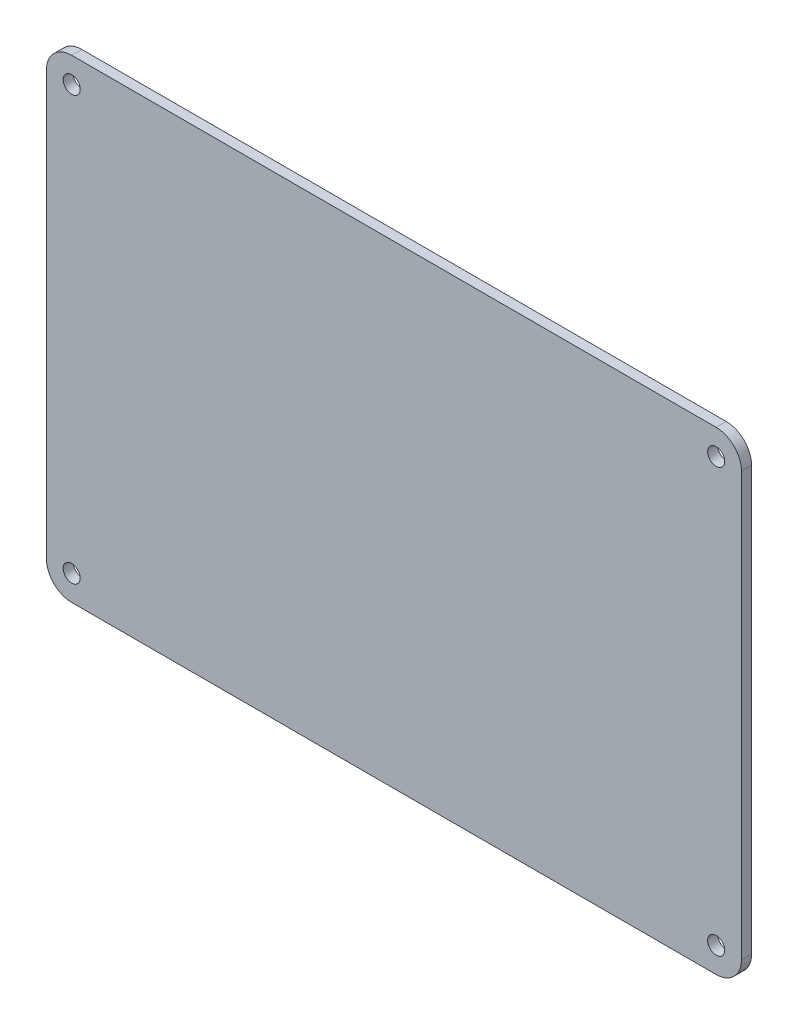
ISO-10303-21;
HEADER;
FILE_DESCRIPTION(('STEP AP214'),'2;1');
FILE_NAME('part.step','',(''),(''),'','','');
FILE_SCHEMA(('AUTOMOTIVE_DESIGN { 1 0 10303 214 1 1 1 1 }'));
ENDSEC;
DATA;
#1=APPLICATION_CONTEXT('core data for automotive mechanical design processes');
#2=APPLICATION_PROTOCOL_DEFINITION('international standard','automotive_design',2000,#1);
#3=PRODUCT_CONTEXT('',#1,'mechanical');
#4=PRODUCT('Part','Part','',(#3));
#5=PRODUCT_RELATED_PRODUCT_CATEGORY('part','',(#4));
#6=PRODUCT_DEFINITION_FORMATION('','',#4);
#7=PRODUCT_DEFINITION_CONTEXT('part definition',#1,'design');
#8=PRODUCT_DEFINITION('design','',#6,#7);
#9=PRODUCT_DEFINITION_SHAPE('','',#8);
#10=(LENGTH_UNIT() NAMED_UNIT(*) SI_UNIT(.MILLI.,.METRE.));
#11=(NAMED_UNIT(*) PLANE_ANGLE_UNIT() SI_UNIT($,.RADIAN.));
#12=(NAMED_UNIT(*) SI_UNIT($,.STERADIAN.) SOLID_ANGLE_UNIT());
#13=UNCERTAINTY_MEASURE_WITH_UNIT(LENGTH_MEASURE(1.E-05),#10,'distance_accuracy_value','');
#14=(GEOMETRIC_REPRESENTATION_CONTEXT(3) GLOBAL_UNCERTAINTY_ASSIGNED_CONTEXT((#13)) GLOBAL_UNIT_ASSIGNED_CONTEXT((#10,
#11,#12)) REPRESENTATION_CONTEXT('',''));
#15=CARTESIAN_POINT('',(0.,0.,0.));
#16=DIRECTION('',(0.,0.,1.));
#17=DIRECTION('',(1.,0.,0.));
#18=AXIS2_PLACEMENT_3D('',#15,#16,#17);
#19=CARTESIAN_POINT('',(-51.,-33.5,1.6));
#20=DIRECTION('',(0.,0.,1.));
#21=DIRECTION('',(1.,0.,0.));
#22=AXIS2_PLACEMENT_3D('',#19,#20,#21);
#23=PLANE('',#22);
#24=CARTESIAN_POINT('',(51.,-33.5,1.6));
#25=DIRECTION('',(0.,0.,1.));
#26=DIRECTION('',(1.,0.,0.));
#27=AXIS2_PLACEMENT_3D('',#24,#25,#26);
#28=CIRCLE('',#27,1.35000000000001);
#29=CARTESIAN_POINT('',(52.35,-33.5,1.6));
#30=VERTEX_POINT('',#29);
#31=EDGE_CURVE('E189',#30,#30,#28,.T.);
#32=ORIENTED_EDGE('',*,*,#31,.F.);
#33=EDGE_LOOP('',(#32));
#34=FACE_BOUND('',#33,.T.);
#35=CARTESIAN_POINT('',(-51.,33.5,1.6));
#36=DIRECTION('',(0.,0.,1.));
#37=DIRECTION('',(1.,0.,0.));
#38=AXIS2_PLACEMENT_3D('',#35,#36,#37);
#39=CIRCLE('',#38,1.35);
#40=CARTESIAN_POINT('',(-49.65,33.5,1.6));
#41=VERTEX_POINT('',#40);
#42=EDGE_CURVE('E135',#41,#41,#39,.T.);
#43=ORIENTED_EDGE('',*,*,#42,.F.);
#44=EDGE_LOOP('',(#43));
#45=FACE_BOUND('',#44,.T.);
#46=CARTESIAN_POINT('',(-51.,-33.5,1.6));
#47=DIRECTION('',(0.,0.,1.));
#48=DIRECTION('',(1.,0.,0.));
#49=AXIS2_PLACEMENT_3D('',#46,#47,#48);
#50=CIRCLE('',#49,4.);
#51=CARTESIAN_POINT('',(-55.,-33.5,1.6));
#52=VERTEX_POINT('',#51);
#53=CARTESIAN_POINT('',(-51.,-37.5,1.6));
#54=VERTEX_POINT('',#53);
#55=EDGE_CURVE('E146',#52,#54,#50,.T.);
#56=ORIENTED_EDGE('',*,*,#55,.T.);
#57=DIRECTION('',(1.,0.,0.));
#58=VECTOR('',#57,1.);
#59=CARTESIAN_POINT('',(-51.,-37.5,1.6));
#60=LINE('',#59,#58);
#61=CARTESIAN_POINT('',(51.,-37.5,1.6));
#62=VERTEX_POINT('',#61);
#63=EDGE_CURVE('E94',#54,#62,#60,.T.);
#64=ORIENTED_EDGE('',*,*,#63,.T.);
#65=CARTESIAN_POINT('',(51.,-33.5,1.6));
#66=DIRECTION('',(0.,0.,1.));
#67=DIRECTION('',(1.,0.,0.));
#68=AXIS2_PLACEMENT_3D('',#65,#66,#67);
#69=CIRCLE('',#68,4.);
#70=CARTESIAN_POINT('',(55.,-33.5,1.6));
#71=VERTEX_POINT('',#70);
#72=EDGE_CURVE('E161',#62,#71,#69,.T.);
#73=ORIENTED_EDGE('',*,*,#72,.T.);
#74=DIRECTION('',(0.,1.,0.));
#75=VECTOR('',#74,1.);
#76=CARTESIAN_POINT('',(55.,-33.5,1.6));
#77=LINE('',#76,#75);
#78=CARTESIAN_POINT('',(55.,33.5,1.6));
#79=VERTEX_POINT('',#78);
#80=EDGE_CURVE('E174',#71,#79,#77,.T.);
#81=ORIENTED_EDGE('',*,*,#80,.T.);
#82=CARTESIAN_POINT('',(51.,33.5,1.6));
#83=DIRECTION('',(0.,0.,1.));
#84=DIRECTION('',(1.,0.,0.));
#85=AXIS2_PLACEMENT_3D('',#82,#83,#84);
#86=CIRCLE('',#85,4.00000000000001);
#87=CARTESIAN_POINT('',(51.,37.5,1.6));
#88=VERTEX_POINT('',#87);
#89=EDGE_CURVE('E113',#79,#88,#86,.T.);
#90=ORIENTED_EDGE('',*,*,#89,.T.);
#91=DIRECTION('',(-1.,0.,0.));
#92=VECTOR('',#91,1.);
#93=CARTESIAN_POINT('',(-51.,37.5,1.6));
#94=LINE('',#93,#92);
#95=CARTESIAN_POINT('',(-51.,37.5,1.6));
#96=VERTEX_POINT('',#95);
#97=EDGE_CURVE('E107',#88,#96,#94,.T.);
#98=ORIENTED_EDGE('',*,*,#97,.T.);
#99=CARTESIAN_POINT('',(-51.,33.5,1.6));
#100=DIRECTION('',(0.,0.,1.));
#101=DIRECTION('',(-1.,0.,0.));
#102=AXIS2_PLACEMENT_3D('',#99,#100,#101);
#103=CIRCLE('',#102,4.00000000000001);
#104=CARTESIAN_POINT('',(-55.,33.5,1.6));
#105=VERTEX_POINT('',#104);
#106=EDGE_CURVE('E111',#96,#105,#103,.T.);
#107=ORIENTED_EDGE('',*,*,#106,.T.);
#108=DIRECTION('',(0.,-1.,0.));
#109=VECTOR('',#108,1.);
#110=CARTESIAN_POINT('',(-55.,-33.5,1.6));
#111=LINE('',#110,#109);
#112=EDGE_CURVE('E51',#105,#52,#111,.T.);
#113=ORIENTED_EDGE('',*,*,#112,.T.);
#114=EDGE_LOOP('',(#56,#64,#73,#81,#90,#98,#107,#113));
#115=FACE_BOUND('',#114,.T.);
#116=CARTESIAN_POINT('',(51.,33.5,1.6));
#117=DIRECTION('',(0.,0.,1.));
#118=DIRECTION('',(1.,0.,0.));
#119=AXIS2_PLACEMENT_3D('',#116,#117,#118);
#120=CIRCLE('',#119,1.35);
#121=CARTESIAN_POINT('',(52.35,33.5,1.6));
#122=VERTEX_POINT('',#121);
#123=EDGE_CURVE('E183',#122,#122,#120,.T.);
#124=ORIENTED_EDGE('',*,*,#123,.F.);
#125=EDGE_LOOP('',(#124));
#126=FACE_BOUND('',#125,.T.);
#127=CARTESIAN_POINT('',(-51.,-33.5,1.6));
#128=DIRECTION('',(0.,0.,1.));
#129=DIRECTION('',(1.,0.,0.));
#130=AXIS2_PLACEMENT_3D('',#127,#128,#129);
#131=CIRCLE('',#130,1.35000000000001);
#132=CARTESIAN_POINT('',(-49.65,-33.5,1.6));
#133=VERTEX_POINT('',#132);
#134=EDGE_CURVE('E195',#133,#133,#131,.T.);
#135=ORIENTED_EDGE('',*,*,#134,.F.);
#136=EDGE_LOOP('',(#135));
#137=FACE_BOUND('',#136,.T.);
#138=ADVANCED_FACE('F34',(#34,#45,#115,#126,#137),#23,.T.);
#139=CARTESIAN_POINT('',(-51.,-33.5,0.));
#140=DIRECTION('',(0.,0.,1.));
#141=DIRECTION('',(1.,0.,0.));
#142=AXIS2_PLACEMENT_3D('',#139,#140,#141);
#143=PLANE('',#142);
#144=CARTESIAN_POINT('',(-51.,-33.5,0.));
#145=DIRECTION('',(0.,0.,1.));
#146=DIRECTION('',(1.,0.,0.));
#147=AXIS2_PLACEMENT_3D('',#144,#145,#146);
#148=CIRCLE('',#147,4.);
#149=CARTESIAN_POINT('',(-55.,-33.5,0.));
#150=VERTEX_POINT('',#149);
#151=CARTESIAN_POINT('',(-51.,-37.5,0.));
#152=VERTEX_POINT('',#151);
#153=EDGE_CURVE('E131',#150,#152,#148,.T.);
#154=ORIENTED_EDGE('',*,*,#153,.F.);
#155=DIRECTION('',(0.,-1.,0.));
#156=VECTOR('',#155,1.);
#157=CARTESIAN_POINT('',(-55.,-33.5,0.));
#158=LINE('',#157,#156);
#159=CARTESIAN_POINT('',(-55.,33.5,0.));
#160=VERTEX_POINT('',#159);
#161=EDGE_CURVE('E86',#160,#150,#158,.T.);
#162=ORIENTED_EDGE('',*,*,#161,.F.);
#163=CARTESIAN_POINT('',(-51.,33.5,0.));
#164=DIRECTION('',(0.,0.,1.));
#165=DIRECTION('',(-1.,0.,0.));
#166=AXIS2_PLACEMENT_3D('',#163,#164,#165);
#167=CIRCLE('',#166,4.00000000000001);
#168=CARTESIAN_POINT('',(-51.,37.5,0.));
#169=VERTEX_POINT('',#168);
#170=EDGE_CURVE('E80',#169,#160,#167,.T.);
#171=ORIENTED_EDGE('',*,*,#170,.F.);
#172=DIRECTION('',(-1.,0.,0.));
#173=VECTOR('',#172,1.);
#174=CARTESIAN_POINT('',(-51.,37.5,0.));
#175=LINE('',#174,#173);
#176=CARTESIAN_POINT('',(51.,37.5,0.));
#177=VERTEX_POINT('',#176);
#178=EDGE_CURVE('E121',#177,#169,#175,.T.);
#179=ORIENTED_EDGE('',*,*,#178,.F.);
#180=CARTESIAN_POINT('',(51.,33.5,0.));
#181=DIRECTION('',(0.,0.,1.));
#182=DIRECTION('',(1.,0.,0.));
#183=AXIS2_PLACEMENT_3D('',#180,#181,#182);
#184=CIRCLE('',#183,4.00000000000001);
#185=CARTESIAN_POINT('',(55.,33.5,0.));
#186=VERTEX_POINT('',#185);
#187=EDGE_CURVE('E141',#186,#177,#184,.T.);
#188=ORIENTED_EDGE('',*,*,#187,.F.);
#189=DIRECTION('',(0.,1.,0.));
#190=VECTOR('',#189,1.);
#191=CARTESIAN_POINT('',(55.,-33.5,0.));
#192=LINE('',#191,#190);
#193=CARTESIAN_POINT('',(55.,-33.5,0.));
#194=VERTEX_POINT('',#193);
#195=EDGE_CURVE('E139',#194,#186,#192,.T.);
#196=ORIENTED_EDGE('',*,*,#195,.F.);
#197=CARTESIAN_POINT('',(51.,-33.5,0.));
#198=DIRECTION('',(0.,0.,1.));
#199=DIRECTION('',(1.,0.,0.));
#200=AXIS2_PLACEMENT_3D('',#197,#198,#199);
#201=CIRCLE('',#200,4.);
#202=CARTESIAN_POINT('',(51.,-37.5,0.));
#203=VERTEX_POINT('',#202);
#204=EDGE_CURVE('E137',#203,#194,#201,.T.);
#205=ORIENTED_EDGE('',*,*,#204,.F.);
#206=DIRECTION('',(1.,0.,0.));
#207=VECTOR('',#206,1.);
#208=CARTESIAN_POINT('',(-51.,-37.5,0.));
#209=LINE('',#208,#207);
#210=EDGE_CURVE('E134',#152,#203,#209,.T.);
#211=ORIENTED_EDGE('',*,*,#210,.F.);
#212=EDGE_LOOP('',(#154,#162,#171,#179,#188,#196,#205,#211));
#213=FACE_BOUND('',#212,.T.);
#214=CARTESIAN_POINT('',(-51.,33.5,0.));
#215=DIRECTION('',(0.,0.,1.));
#216=DIRECTION('',(1.,0.,0.));
#217=AXIS2_PLACEMENT_3D('',#214,#215,#216);
#218=CIRCLE('',#217,1.35);
#219=CARTESIAN_POINT('',(-49.65,33.5,0.));
#220=VERTEX_POINT('',#219);
#221=EDGE_CURVE('E180',#220,#220,#218,.T.);
#222=ORIENTED_EDGE('',*,*,#221,.T.);
#223=EDGE_LOOP('',(#222));
#224=FACE_BOUND('',#223,.T.);
#225=CARTESIAN_POINT('',(51.,33.5,0.));
#226=DIRECTION('',(0.,0.,1.));
#227=DIRECTION('',(1.,0.,0.));
#228=AXIS2_PLACEMENT_3D('',#225,#226,#227);
#229=CIRCLE('',#228,1.35);
#230=CARTESIAN_POINT('',(52.35,33.5,0.));
#231=VERTEX_POINT('',#230);
#232=EDGE_CURVE('E186',#231,#231,#229,.T.);
#233=ORIENTED_EDGE('',*,*,#232,.T.);
#234=EDGE_LOOP('',(#233));
#235=FACE_BOUND('',#234,.T.);
#236=CARTESIAN_POINT('',(51.,-33.5,0.));
#237=DIRECTION('',(0.,0.,1.));
#238=DIRECTION('',(1.,0.,0.));
#239=AXIS2_PLACEMENT_3D('',#236,#237,#238);
#240=CIRCLE('',#239,1.35000000000001);
#241=CARTESIAN_POINT('',(52.35,-33.5,0.));
#242=VERTEX_POINT('',#241);
#243=EDGE_CURVE('E192',#242,#242,#240,.T.);
#244=ORIENTED_EDGE('',*,*,#243,.T.);
#245=EDGE_LOOP('',(#244));
#246=FACE_BOUND('',#245,.T.);
#247=CARTESIAN_POINT('',(-51.,-33.5,0.));
#248=DIRECTION('',(0.,0.,1.));
#249=DIRECTION('',(1.,0.,0.));
#250=AXIS2_PLACEMENT_3D('',#247,#248,#249);
#251=CIRCLE('',#250,1.35000000000001);
#252=CARTESIAN_POINT('',(-49.65,-33.5,0.));
#253=VERTEX_POINT('',#252);
#254=EDGE_CURVE('E198',#253,#253,#251,.T.);
#255=ORIENTED_EDGE('',*,*,#254,.T.);
#256=EDGE_LOOP('',(#255));
#257=FACE_BOUND('',#256,.T.);
#258=ADVANCED_FACE('F165',(#213,#224,#235,#246,#257),#143,.F.);
#259=CARTESIAN_POINT('',(-51.,-33.5,1.6));
#260=DIRECTION('',(0.,0.,-1.));
#261=DIRECTION('',(-1.,0.,0.));
#262=AXIS2_PLACEMENT_3D('',#259,#260,#261);
#263=CYLINDRICAL_SURFACE('',#262,4.);
#264=ORIENTED_EDGE('',*,*,#153,.T.);
#265=DIRECTION('',(0.,0.,-1.));
#266=VECTOR('',#265,1.);
#267=CARTESIAN_POINT('',(-51.,-37.5,1.6));
#268=LINE('',#267,#266);
#269=EDGE_CURVE('E11',#54,#152,#268,.T.);
#270=ORIENTED_EDGE('',*,*,#269,.F.);
#271=ORIENTED_EDGE('',*,*,#55,.F.);
#272=DIRECTION('',(0.,0.,-1.));
#273=VECTOR('',#272,1.);
#274=CARTESIAN_POINT('',(-55.,-33.5,1.6));
#275=LINE('',#274,#273);
#276=EDGE_CURVE('E127',#52,#150,#275,.T.);
#277=ORIENTED_EDGE('',*,*,#276,.T.);
#278=EDGE_LOOP('',(#264,#270,#271,#277));
#279=FACE_BOUND('',#278,.T.);
#280=ADVANCED_FACE('F36',(#279),#263,.T.);
#281=CARTESIAN_POINT('',(-51.,-37.5,1.6));
#282=DIRECTION('',(0.,1.,0.));
#283=DIRECTION('',(0.,0.,1.));
#284=AXIS2_PLACEMENT_3D('',#281,#282,#283);
#285=PLANE('',#284);
#286=ORIENTED_EDGE('',*,*,#210,.T.);
#287=DIRECTION('',(0.,0.,-1.));
#288=VECTOR('',#287,1.);
#289=CARTESIAN_POINT('',(51.,-37.5,1.6));
#290=LINE('',#289,#288);
#291=EDGE_CURVE('E43',#62,#203,#290,.T.);
#292=ORIENTED_EDGE('',*,*,#291,.F.);
#293=ORIENTED_EDGE('',*,*,#63,.F.);
#294=ORIENTED_EDGE('',*,*,#269,.T.);
#295=EDGE_LOOP('',(#286,#292,#293,#294));
#296=FACE_BOUND('',#295,.T.);
#297=ADVANCED_FACE('F232',(#296),#285,.F.);
#298=CARTESIAN_POINT('',(51.,-33.5,1.6));
#299=DIRECTION('',(0.,0.,-1.));
#300=DIRECTION('',(-1.,0.,0.));
#301=AXIS2_PLACEMENT_3D('',#298,#299,#300);
#302=CYLINDRICAL_SURFACE('',#301,4.);
#303=ORIENTED_EDGE('',*,*,#204,.T.);
#304=DIRECTION('',(0.,0.,-1.));
#305=VECTOR('',#304,1.);
#306=CARTESIAN_POINT('',(55.,-33.5,1.6));
#307=LINE('',#306,#305);
#308=EDGE_CURVE('E153',#71,#194,#307,.T.);
#309=ORIENTED_EDGE('',*,*,#308,.F.);
#310=ORIENTED_EDGE('',*,*,#72,.F.);
#311=ORIENTED_EDGE('',*,*,#291,.T.);
#312=EDGE_LOOP('',(#303,#309,#310,#311));
#313=FACE_BOUND('',#312,.T.);
#314=ADVANCED_FACE('F159',(#313),#302,.T.);
#315=CARTESIAN_POINT('',(55.,-33.5,1.6));
#316=DIRECTION('',(-1.,0.,0.));
#317=DIRECTION('',(0.,-1.,0.));
#318=AXIS2_PLACEMENT_3D('',#315,#316,#317);
#319=PLANE('',#318);
#320=ORIENTED_EDGE('',*,*,#195,.T.);
#321=DIRECTION('',(0.,0.,-1.));
#322=VECTOR('',#321,1.);
#323=CARTESIAN_POINT('',(55.,33.5,1.6));
#324=LINE('',#323,#322);
#325=EDGE_CURVE('E150',#79,#186,#324,.T.);
#326=ORIENTED_EDGE('',*,*,#325,.F.);
#327=ORIENTED_EDGE('',*,*,#80,.F.);
#328=ORIENTED_EDGE('',*,*,#308,.T.);
#329=EDGE_LOOP('',(#320,#326,#327,#328));
#330=FACE_BOUND('',#329,.T.);
#331=ADVANCED_FACE('F170',(#330),#319,.F.);
#332=CARTESIAN_POINT('',(51.,33.5,1.6));
#333=DIRECTION('',(0.,0.,-1.));
#334=DIRECTION('',(-1.,0.,0.));
#335=AXIS2_PLACEMENT_3D('',#332,#333,#334);
#336=CYLINDRICAL_SURFACE('',#335,4.00000000000001);
#337=ORIENTED_EDGE('',*,*,#187,.T.);
#338=DIRECTION('',(0.,0.,-1.));
#339=VECTOR('',#338,1.);
#340=CARTESIAN_POINT('',(51.,37.5,1.6));
#341=LINE('',#340,#339);
#342=EDGE_CURVE('E122',#88,#177,#341,.T.);
#343=ORIENTED_EDGE('',*,*,#342,.F.);
#344=ORIENTED_EDGE('',*,*,#89,.F.);
#345=ORIENTED_EDGE('',*,*,#325,.T.);
#346=EDGE_LOOP('',(#337,#343,#344,#345));
#347=FACE_BOUND('',#346,.T.);
#348=ADVANCED_FACE('F173',(#347),#336,.T.);
#349=CARTESIAN_POINT('',(-51.,37.5,1.6));
#350=DIRECTION('',(0.,-1.,0.));
#351=DIRECTION('',(0.,0.,-1.));
#352=AXIS2_PLACEMENT_3D('',#349,#350,#351);
#353=PLANE('',#352);
#354=ORIENTED_EDGE('',*,*,#178,.T.);
#355=DIRECTION('',(0.,0.,-1.));
#356=VECTOR('',#355,1.);
#357=CARTESIAN_POINT('',(-51.,37.5,1.6));
#358=LINE('',#357,#356);
#359=EDGE_CURVE('E118',#96,#169,#358,.T.);
#360=ORIENTED_EDGE('',*,*,#359,.F.);
#361=ORIENTED_EDGE('',*,*,#97,.F.);
#362=ORIENTED_EDGE('',*,*,#342,.T.);
#363=EDGE_LOOP('',(#354,#360,#361,#362));
#364=FACE_BOUND('',#363,.T.);
#365=ADVANCED_FACE('F119',(#364),#353,.F.);
#366=CARTESIAN_POINT('',(-51.,33.5,1.6));
#367=DIRECTION('',(0.,0.,-1.));
#368=DIRECTION('',(-1.,0.,0.));
#369=AXIS2_PLACEMENT_3D('',#366,#367,#368);
#370=CYLINDRICAL_SURFACE('',#369,4.00000000000001);
#371=ORIENTED_EDGE('',*,*,#170,.T.);
#372=DIRECTION('',(0.,0.,-1.));
#373=VECTOR('',#372,1.);
#374=CARTESIAN_POINT('',(-55.,33.5,1.6));
#375=LINE('',#374,#373);
#376=EDGE_CURVE('E123',#105,#160,#375,.T.);
#377=ORIENTED_EDGE('',*,*,#376,.F.);
#378=ORIENTED_EDGE('',*,*,#106,.F.);
#379=ORIENTED_EDGE('',*,*,#359,.T.);
#380=EDGE_LOOP('',(#371,#377,#378,#379));
#381=FACE_BOUND('',#380,.T.);
#382=ADVANCED_FACE('F125',(#381),#370,.T.);
#383=CARTESIAN_POINT('',(-55.,-33.5,1.6));
#384=DIRECTION('',(1.,0.,0.));
#385=DIRECTION('',(0.,1.,0.));
#386=AXIS2_PLACEMENT_3D('',#383,#384,#385);
#387=PLANE('',#386);
#388=ORIENTED_EDGE('',*,*,#161,.T.);
#389=ORIENTED_EDGE('',*,*,#276,.F.);
#390=ORIENTED_EDGE('',*,*,#112,.F.);
#391=ORIENTED_EDGE('',*,*,#376,.T.);
#392=EDGE_LOOP('',(#388,#389,#390,#391));
#393=FACE_BOUND('',#392,.T.);
#394=ADVANCED_FACE('F220',(#393),#387,.F.);
#395=CARTESIAN_POINT('',(-51.,33.5,1.6));
#396=DIRECTION('',(0.,0.,-1.));
#397=DIRECTION('',(-1.,0.,0.));
#398=AXIS2_PLACEMENT_3D('',#395,#396,#397);
#399=CYLINDRICAL_SURFACE('',#398,1.35);
#400=ORIENTED_EDGE('',*,*,#42,.T.);
#401=EDGE_LOOP('',(#400));
#402=FACE_BOUND('',#401,.T.);
#403=ORIENTED_EDGE('',*,*,#221,.F.);
#404=EDGE_LOOP('',(#403));
#405=FACE_BOUND('',#404,.T.);
#406=ADVANCED_FACE('F217',(#402,#405),#399,.F.);
#407=CARTESIAN_POINT('',(51.,33.5,1.6));
#408=DIRECTION('',(0.,0.,-1.));
#409=DIRECTION('',(-1.,0.,0.));
#410=AXIS2_PLACEMENT_3D('',#407,#408,#409);
#411=CYLINDRICAL_SURFACE('',#410,1.35);
#412=ORIENTED_EDGE('',*,*,#123,.T.);
#413=EDGE_LOOP('',(#412));
#414=FACE_BOUND('',#413,.T.);
#415=ORIENTED_EDGE('',*,*,#232,.F.);
#416=EDGE_LOOP('',(#415));
#417=FACE_BOUND('',#416,.T.);
#418=ADVANCED_FACE('F296',(#414,#417),#411,.F.);
#419=CARTESIAN_POINT('',(51.,-33.5,1.6));
#420=DIRECTION('',(0.,0.,-1.));
#421=DIRECTION('',(-1.,0.,0.));
#422=AXIS2_PLACEMENT_3D('',#419,#420,#421);
#423=CYLINDRICAL_SURFACE('',#422,1.35000000000001);
#424=ORIENTED_EDGE('',*,*,#31,.T.);
#425=EDGE_LOOP('',(#424));
#426=FACE_BOUND('',#425,.T.);
#427=ORIENTED_EDGE('',*,*,#243,.F.);
#428=EDGE_LOOP('',(#427));
#429=FACE_BOUND('',#428,.T.);
#430=ADVANCED_FACE('F304',(#426,#429),#423,.F.);
#431=CARTESIAN_POINT('',(-51.,-33.5,1.6));
#432=DIRECTION('',(0.,0.,-1.));
#433=DIRECTION('',(-1.,0.,0.));
#434=AXIS2_PLACEMENT_3D('',#431,#432,#433);
#435=CYLINDRICAL_SURFACE('',#434,1.35000000000001);
#436=ORIENTED_EDGE('',*,*,#134,.T.);
#437=EDGE_LOOP('',(#436));
#438=FACE_BOUND('',#437,.T.);
#439=ORIENTED_EDGE('',*,*,#254,.F.);
#440=EDGE_LOOP('',(#439));
#441=FACE_BOUND('',#440,.T.);
#442=ADVANCED_FACE('F204',(#438,#441),#435,.F.);
#443=CLOSED_SHELL('',(#138,#258,#280,#297,#314,#331,#348,#365,#382,#394,#406,#418,#430,#442));
#444=MANIFOLD_SOLID_BREP('B2',#443);
#445=ADVANCED_BREP_SHAPE_REPRESENTATION('',(#18,#444),#14);
#446=SHAPE_DEFINITION_REPRESENTATION(#9,#445);
ENDSEC;
END-ISO-10303-21;
